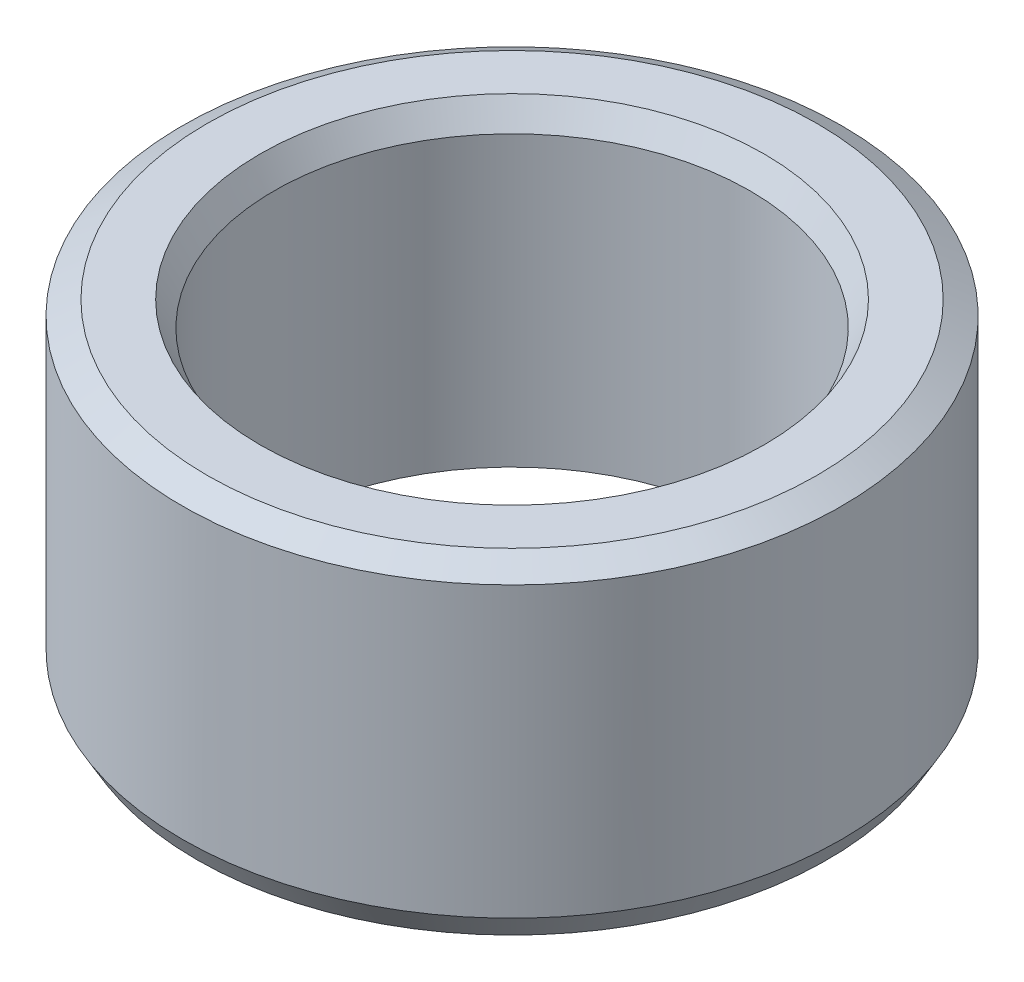
ISO-10303-21;
HEADER;
FILE_DESCRIPTION(('STEP AP214'),'2;1');
FILE_NAME('part.step','',(''),(''),'','','');
FILE_SCHEMA(('AUTOMOTIVE_DESIGN { 1 0 10303 214 1 1 1 1 }'));
ENDSEC;
DATA;
#1=APPLICATION_CONTEXT('core data for automotive mechanical design processes');
#2=APPLICATION_PROTOCOL_DEFINITION('international standard','automotive_design',2000,#1);
#3=PRODUCT_CONTEXT('',#1,'mechanical');
#4=PRODUCT('Part','Part','',(#3));
#5=PRODUCT_RELATED_PRODUCT_CATEGORY('part','',(#4));
#6=PRODUCT_DEFINITION_FORMATION('','',#4);
#7=PRODUCT_DEFINITION_CONTEXT('part definition',#1,'design');
#8=PRODUCT_DEFINITION('design','',#6,#7);
#9=PRODUCT_DEFINITION_SHAPE('','',#8);
#10=(LENGTH_UNIT() NAMED_UNIT(*) SI_UNIT(.MILLI.,.METRE.));
#11=(NAMED_UNIT(*) PLANE_ANGLE_UNIT() SI_UNIT($,.RADIAN.));
#12=(NAMED_UNIT(*) SI_UNIT($,.STERADIAN.) SOLID_ANGLE_UNIT());
#13=UNCERTAINTY_MEASURE_WITH_UNIT(LENGTH_MEASURE(1.E-05),#10,'distance_accuracy_value','');
#14=(GEOMETRIC_REPRESENTATION_CONTEXT(3) GLOBAL_UNCERTAINTY_ASSIGNED_CONTEXT((#13)) GLOBAL_UNIT_ASSIGNED_CONTEXT((#10,
#11,#12)) REPRESENTATION_CONTEXT('',''));
#15=CARTESIAN_POINT('',(0.,0.,0.));
#16=DIRECTION('',(0.,0.,1.));
#17=DIRECTION('',(1.,0.,0.));
#18=AXIS2_PLACEMENT_3D('',#15,#16,#17);
#19=CARTESIAN_POINT('',(0.,22.3650630023718,0.));
#20=DIRECTION('',(0.,-1.,0.));
#21=DIRECTION('',(0.,0.,-1.));
#22=AXIS2_PLACEMENT_3D('',#19,#20,#21);
#23=CYLINDRICAL_SURFACE('',#22,22.5);
#24=CARTESIAN_POINT('',(0.,1.68651742115444,0.));
#25=DIRECTION('',(0.,1.,0.));
#26=DIRECTION('',(0.,0.,1.));
#27=AXIS2_PLACEMENT_3D('',#24,#25,#26);
#28=CIRCLE('',#27,22.5);
#29=CARTESIAN_POINT('',(0.,1.68651742115444,-22.5));
#30=VERTEX_POINT('',#29);
#31=EDGE_CURVE('E10',#30,#30,#28,.T.);
#32=CARTESIAN_POINT('',(0.,21.3913517152753,0.));
#33=DIRECTION('',(0.,1.,0.));
#34=DIRECTION('',(0.,0.,1.));
#35=AXIS2_PLACEMENT_3D('',#32,#33,#34);
#36=CIRCLE('',#35,22.5);
#37=CARTESIAN_POINT('',(0.,21.3913517152753,-22.5));
#38=VERTEX_POINT('',#37);
#39=EDGE_CURVE('E50',#38,#38,#36,.F.);
#40=CARTESIAN_POINT('',(0.,1.68651742115444,-22.5));
#41=CARTESIAN_POINT('',(0.,1.8917761117182,-22.5));
#42=CARTESIAN_POINT('',(0.,2.09703480228196,-22.5));
#43=CARTESIAN_POINT('',(0.,2.50755218340948,-22.5));
#44=CARTESIAN_POINT('',(0.,2.71281087397324,-22.5));
#45=CARTESIAN_POINT('',(0.,3.12332825510076,-22.5));
#46=CARTESIAN_POINT('',(0.,3.32858694566452,-22.5));
#47=CARTESIAN_POINT('',(0.,3.73910432679203,-22.5));
#48=CARTESIAN_POINT('',(0.,3.94436301735579,-22.5));
#49=CARTESIAN_POINT('',(0.,4.35488039848331,-22.5));
#50=CARTESIAN_POINT('',(0.,4.56013908904707,-22.5));
#51=CARTESIAN_POINT('',(0.,4.97065647017459,-22.5));
#52=CARTESIAN_POINT('',(0.,5.17591516073835,-22.5));
#53=CARTESIAN_POINT('',(0.,5.58643254186587,-22.5));
#54=CARTESIAN_POINT('',(0.,5.79169123242963,-22.5));
#55=CARTESIAN_POINT('',(0.,6.20220861355714,-22.5));
#56=CARTESIAN_POINT('',(0.,6.4074673041209,-22.5));
#57=CARTESIAN_POINT('',(0.,6.81798468524842,-22.5));
#58=CARTESIAN_POINT('',(0.,7.02324337581218,-22.5));
#59=CARTESIAN_POINT('',(0.,7.4337607569397,-22.5));
#60=CARTESIAN_POINT('',(0.,7.63901944750346,-22.5));
#61=CARTESIAN_POINT('',(0.,8.04953682863097,-22.5));
#62=CARTESIAN_POINT('',(0.,8.25479551919473,-22.5));
#63=CARTESIAN_POINT('',(0.,8.66531290032225,-22.5));
#64=CARTESIAN_POINT('',(0.,8.87057159088601,-22.5));
#65=CARTESIAN_POINT('',(0.,9.28108897201353,-22.5));
#66=CARTESIAN_POINT('',(0.,9.48634766257729,-22.5));
#67=CARTESIAN_POINT('',(0.,9.89686504370481,-22.5));
#68=CARTESIAN_POINT('',(0.,10.1021237342686,-22.5));
#69=CARTESIAN_POINT('',(0.,10.5126411153961,-22.5));
#70=CARTESIAN_POINT('',(0.,10.7178998059598,-22.5));
#71=CARTESIAN_POINT('',(0.,11.1284171870874,-22.5));
#72=CARTESIAN_POINT('',(0.,11.3336758776511,-22.5));
#73=CARTESIAN_POINT('',(0.,11.7441932587786,-22.5));
#74=CARTESIAN_POINT('',(0.,11.9494519493424,-22.5));
#75=CARTESIAN_POINT('',(0.,12.3599693304699,-22.5));
#76=CARTESIAN_POINT('',(0.,12.5652280210337,-22.5));
#77=CARTESIAN_POINT('',(0.,12.9757454021612,-22.5));
#78=CARTESIAN_POINT('',(0.,13.181004092725,-22.5));
#79=CARTESIAN_POINT('',(0.,13.5915214738525,-22.5));
#80=CARTESIAN_POINT('',(0.,13.7967801644162,-22.5));
#81=CARTESIAN_POINT('',(0.,14.2072975455437,-22.5));
#82=CARTESIAN_POINT('',(0.,14.4125562361075,-22.5));
#83=CARTESIAN_POINT('',(0.,14.823073617235,-22.5));
#84=CARTESIAN_POINT('',(0.,15.0283323077988,-22.5));
#85=CARTESIAN_POINT('',(0.,15.4388496889263,-22.5));
#86=CARTESIAN_POINT('',(0.,15.6441083794901,-22.5));
#87=CARTESIAN_POINT('',(0.,16.0546257606176,-22.5));
#88=CARTESIAN_POINT('',(0.,16.2598844511813,-22.5));
#89=CARTESIAN_POINT('',(0.,16.6704018323089,-22.5));
#90=CARTESIAN_POINT('',(0.,16.8756605228726,-22.5));
#91=CARTESIAN_POINT('',(0.,17.2861779040001,-22.5));
#92=CARTESIAN_POINT('',(0.,17.4914365945639,-22.5));
#93=CARTESIAN_POINT('',(0.,17.9019539756914,-22.5));
#94=CARTESIAN_POINT('',(0.,18.1072126662552,-22.5));
#95=CARTESIAN_POINT('',(0.,18.5177300473827,-22.5));
#96=CARTESIAN_POINT('',(0.,18.7229887379465,-22.5));
#97=CARTESIAN_POINT('',(0.,19.133506119074,-22.5));
#98=CARTESIAN_POINT('',(0.,19.3387648096377,-22.5));
#99=CARTESIAN_POINT('',(0.,19.7492821907652,-22.5));
#100=CARTESIAN_POINT('',(0.,19.954540881329,-22.5));
#101=CARTESIAN_POINT('',(0.,20.3650582624565,-22.5));
#102=CARTESIAN_POINT('',(0.,20.5703169530203,-22.5));
#103=CARTESIAN_POINT('',(0.,20.9808343341478,-22.5));
#104=CARTESIAN_POINT('',(0.,21.1860930247116,-22.5));
#105=CARTESIAN_POINT('',(0.,21.3913517152753,-22.5));
#106=B_SPLINE_CURVE_WITH_KNOTS('',3,(#40,#41,#42,#43,#44,#45,#46,#47,#48,#49,#50,#51,#52,#53,
#54,#55,#56,#57,#58,#59,#60,#61,#62,#63,#64,#65,#66,#67,#68,#69,#70,#71,#72,#73,#74,#75,#76,#77,
#78,#79,#80,#81,#82,#83,#84,#85,#86,#87,#88,#89,#90,#91,#92,#93,#94,#95,#96,#97,#98,#99,#100,
#101,#102,#103,#104,#105),.UNSPECIFIED.,.F.,.F.,(4,2,2,2,2,2,2,2,2,2,2,2,2,2,2,2,2,2,2,2,2,2,2,
2,2,2,2,2,2,2,2,2,4),(0.,0.615776071691276,1.23155214338256,1.84732821507383,2.46310428676511,
3.07888035845639,3.69465643014767,4.31043250183894,4.92620857353022,5.5419846452215,
6.15776071691277,6.77353678860405,7.38931286029533,8.0050889319866,8.62086500367788,
9.23664107536916,9.85241714706044,10.4681932187517,11.083969290443,11.6997453621343,
12.3155214338255,12.9312975055168,13.5470735772081,14.1628496488994,14.7786257205907,
15.3944017922819,16.0101778639732,16.6259539356645,17.2417300073558,17.857506079047,
18.4732821507383,19.0890582224296,19.7048342941209),.UNSPECIFIED.);
#107=EDGE_CURVE('BSEAM39',#30,#38,#106,.T.);
#108=ORIENTED_EDGE('',*,*,#31,.T.);
#109=ORIENTED_EDGE('',*,*,#39,.T.);
#110=ORIENTED_EDGE('',*,*,#107,.T.);
#111=ORIENTED_EDGE('',*,*,#107,.F.);
#112=EDGE_LOOP('',(#108,#110,#109,#111));
#113=FACE_BOUND('',#112,.T.);
#114=ADVANCED_FACE('F39',(#113),#23,.T.);
#115=CARTESIAN_POINT('',(0.,22.3650630023718,0.));
#116=DIRECTION('',(0.,1.,0.));
#117=DIRECTION('',(0.,0.,1.));
#118=AXIS2_PLACEMENT_3D('',#115,#116,#117);
#119=PLANE('',#118);
#120=CARTESIAN_POINT('',(0.,22.3650630023718,0.));
#121=DIRECTION('',(0.,1.,0.));
#122=DIRECTION('',(0.,0.,1.));
#123=AXIS2_PLACEMENT_3D('',#120,#121,#122);
#124=CIRCLE('',#123,17.2061405656379);
#125=CARTESIAN_POINT('',(0.,22.3650630023718,17.2061405656379));
#126=VERTEX_POINT('',#125);
#127=EDGE_CURVE('E58',#126,#126,#124,.F.);
#128=ORIENTED_EDGE('',*,*,#127,.T.);
#129=EDGE_LOOP('',(#128));
#130=FACE_BOUND('',#129,.T.);
#131=CARTESIAN_POINT('',(0.,22.3650630023718,0.));
#132=DIRECTION('',(0.,1.,0.));
#133=DIRECTION('',(0.,0.,1.));
#134=AXIS2_PLACEMENT_3D('',#131,#132,#133);
#135=CIRCLE('',#134,20.8134825788457);
#136=CARTESIAN_POINT('',(0.,22.3650630023718,20.8134825788457));
#137=VERTEX_POINT('',#136);
#138=EDGE_CURVE('E61',#137,#137,#135,.T.);
#139=ORIENTED_EDGE('',*,*,#138,.T.);
#140=EDGE_LOOP('',(#139));
#141=FACE_BOUND('',#140,.T.);
#142=ADVANCED_FACE('F88',(#130,#141),#119,.T.);
#143=CARTESIAN_POINT('',(0.,0.,0.));
#144=DIRECTION('',(0.,1.,0.));
#145=DIRECTION('',(0.,0.,1.));
#146=AXIS2_PLACEMENT_3D('',#143,#144,#145);
#147=PLANE('',#146);
#148=CARTESIAN_POINT('',(0.,0.,0.));
#149=DIRECTION('',(0.,1.,0.));
#150=DIRECTION('',(0.,0.,1.));
#151=AXIS2_PLACEMENT_3D('',#148,#149,#150);
#152=CIRCLE('',#151,17.9189466996957);
#153=CARTESIAN_POINT('',(0.,0.,17.9189466996957));
#154=VERTEX_POINT('',#153);
#155=EDGE_CURVE('E51',#154,#154,#152,.T.);
#156=ORIENTED_EDGE('',*,*,#155,.T.);
#157=EDGE_LOOP('',(#156));
#158=FACE_BOUND('',#157,.T.);
#159=CARTESIAN_POINT('',(0.,0.,0.));
#160=DIRECTION('',(0.,1.,0.));
#161=DIRECTION('',(0.,0.,1.));
#162=AXIS2_PLACEMENT_3D('',#159,#160,#161);
#163=CIRCLE('',#162,21.5262887129035);
#164=CARTESIAN_POINT('',(0.,0.,21.5262887129035));
#165=VERTEX_POINT('',#164);
#166=EDGE_CURVE('E54',#165,#165,#163,.F.);
#167=ORIENTED_EDGE('',*,*,#166,.T.);
#168=EDGE_LOOP('',(#167));
#169=FACE_BOUND('',#168,.T.);
#170=ADVANCED_FACE('F83',(#158,#169),#147,.F.);
#171=CARTESIAN_POINT('',(0.,22.3650630023718,0.));
#172=DIRECTION('',(0.,-1.,0.));
#173=DIRECTION('',(0.,0.,-1.));
#174=AXIS2_PLACEMENT_3D('',#171,#172,#173);
#175=CYLINDRICAL_SURFACE('',#174,16.2324292785414);
#176=CARTESIAN_POINT('',(0.,20.6785455812173,0.));
#177=DIRECTION('',(0.,1.,0.));
#178=DIRECTION('',(0.,0.,1.));
#179=AXIS2_PLACEMENT_3D('',#176,#177,#178);
#180=CIRCLE('',#179,16.2324292785414);
#181=CARTESIAN_POINT('',(0.,20.6785455812173,-16.2324292785414));
#182=VERTEX_POINT('',#181);
#183=EDGE_CURVE('E67',#182,#182,#180,.T.);
#184=CARTESIAN_POINT('',(0.,0.97371128709647,0.));
#185=DIRECTION('',(0.,1.,0.));
#186=DIRECTION('',(0.,0.,1.));
#187=AXIS2_PLACEMENT_3D('',#184,#185,#186);
#188=CIRCLE('',#187,16.2324292785414);
#189=CARTESIAN_POINT('',(0.,0.973711287096467,-16.2324292785414));
#190=VERTEX_POINT('',#189);
#191=EDGE_CURVE('E69',#190,#190,#188,.F.);
#192=CARTESIAN_POINT('',(0.,20.6785455812173,-16.2324292785414));
#193=CARTESIAN_POINT('',(0.,20.4732868906536,-16.2324292785414));
#194=CARTESIAN_POINT('',(0.,20.2680282000898,-16.2324292785414));
#195=CARTESIAN_POINT('',(0.,19.8575108189623,-16.2324292785414));
#196=CARTESIAN_POINT('',(0.,19.6522521283985,-16.2324292785414));
#197=CARTESIAN_POINT('',(0.,19.241734747271,-16.2324292785414));
#198=CARTESIAN_POINT('',(0.,19.0364760567073,-16.2324292785414));
#199=CARTESIAN_POINT('',(0.,18.6259586755797,-16.2324292785414));
#200=CARTESIAN_POINT('',(0.,18.420699985016,-16.2324292785414));
#201=CARTESIAN_POINT('',(0.,18.0101826038885,-16.2324292785414));
#202=CARTESIAN_POINT('',(0.,17.8049239133247,-16.2324292785414));
#203=CARTESIAN_POINT('',(0.,17.3944065321972,-16.2324292785414));
#204=CARTESIAN_POINT('',(0.,17.1891478416334,-16.2324292785414));
#205=CARTESIAN_POINT('',(0.,16.7786304605059,-16.2324292785414));
#206=CARTESIAN_POINT('',(0.,16.5733717699421,-16.2324292785414));
#207=CARTESIAN_POINT('',(0.,16.1628543888146,-16.2324292785414));
#208=CARTESIAN_POINT('',(0.,15.9575956982509,-16.2324292785414));
#209=CARTESIAN_POINT('',(0.,15.5470783171234,-16.2324292785414));
#210=CARTESIAN_POINT('',(0.,15.3418196265596,-16.2324292785414));
#211=CARTESIAN_POINT('',(0.,14.9313022454321,-16.2324292785414));
#212=CARTESIAN_POINT('',(0.,14.7260435548683,-16.2324292785414));
#213=CARTESIAN_POINT('',(0.,14.3155261737408,-16.2324292785414));
#214=CARTESIAN_POINT('',(0.,14.110267483177,-16.2324292785414));
#215=CARTESIAN_POINT('',(0.,13.6997501020495,-16.2324292785414));
#216=CARTESIAN_POINT('',(0.,13.4944914114858,-16.2324292785414));
#217=CARTESIAN_POINT('',(0.,13.0839740303582,-16.2324292785414));
#218=CARTESIAN_POINT('',(0.,12.8787153397945,-16.2324292785414));
#219=CARTESIAN_POINT('',(0.,12.468197958667,-16.2324292785414));
#220=CARTESIAN_POINT('',(0.,12.2629392681032,-16.2324292785414));
#221=CARTESIAN_POINT('',(0.,11.8524218869757,-16.2324292785414));
#222=CARTESIAN_POINT('',(0.,11.6471631964119,-16.2324292785414));
#223=CARTESIAN_POINT('',(0.,11.2366458152844,-16.2324292785414));
#224=CARTESIAN_POINT('',(0.,11.0313871247207,-16.2324292785414));
#225=CARTESIAN_POINT('',(0.,10.6208697435931,-16.2324292785414));
#226=CARTESIAN_POINT('',(0.,10.4156110530294,-16.2324292785414));
#227=CARTESIAN_POINT('',(0.,10.0050936719019,-16.2324292785414));
#228=CARTESIAN_POINT('',(0.,9.7998349813381,-16.2324292785414));
#229=CARTESIAN_POINT('',(0.,9.38931760021058,-16.2324292785414));
#230=CARTESIAN_POINT('',(0.,9.18405890964682,-16.2324292785414));
#231=CARTESIAN_POINT('',(0.,8.77354152851931,-16.2324292785414));
#232=CARTESIAN_POINT('',(0.,8.56828283795554,-16.2324292785414));
#233=CARTESIAN_POINT('',(0.,8.15776545682803,-16.2324292785414));
#234=CARTESIAN_POINT('',(0.,7.95250676626427,-16.2324292785414));
#235=CARTESIAN_POINT('',(0.,7.54198938513675,-16.2324292785414));
#236=CARTESIAN_POINT('',(0.,7.33673069457299,-16.2324292785414));
#237=CARTESIAN_POINT('',(0.,6.92621331344547,-16.2324292785414));
#238=CARTESIAN_POINT('',(0.,6.72095462288172,-16.2324292785414));
#239=CARTESIAN_POINT('',(0.,6.3104372417542,-16.2324292785414));
#240=CARTESIAN_POINT('',(0.,6.10517855119044,-16.2324292785414));
#241=CARTESIAN_POINT('',(0.,5.69466117006292,-16.2324292785414));
#242=CARTESIAN_POINT('',(0.,5.48940247949916,-16.2324292785414));
#243=CARTESIAN_POINT('',(0.,5.07888509837164,-16.2324292785414));
#244=CARTESIAN_POINT('',(0.,4.87362640780788,-16.2324292785414));
#245=CARTESIAN_POINT('',(0.,4.46310902668037,-16.2324292785414));
#246=CARTESIAN_POINT('',(0.,4.25785033611661,-16.2324292785414));
#247=CARTESIAN_POINT('',(0.,3.84733295498909,-16.2324292785414));
#248=CARTESIAN_POINT('',(0.,3.64207426442533,-16.2324292785414));
#249=CARTESIAN_POINT('',(0.,3.23155688329781,-16.2324292785414));
#250=CARTESIAN_POINT('',(0.,3.02629819273405,-16.2324292785414));
#251=CARTESIAN_POINT('',(0.,2.61578081160654,-16.2324292785414));
#252=CARTESIAN_POINT('',(0.,2.41052212104278,-16.2324292785414));
#253=CARTESIAN_POINT('',(0.,2.00000473991526,-16.2324292785414));
#254=CARTESIAN_POINT('',(0.,1.7947460493515,-16.2324292785414));
#255=CARTESIAN_POINT('',(0.,1.38422866822398,-16.2324292785414));
#256=CARTESIAN_POINT('',(0.,1.17896997766023,-16.2324292785414));
#257=CARTESIAN_POINT('',(0.,0.973711287096467,-16.2324292785414));
#258=B_SPLINE_CURVE_WITH_KNOTS('',3,(#192,#193,#194,#195,#196,#197,#198,#199,#200,#201,#202,
#203,#204,#205,#206,#207,#208,#209,#210,#211,#212,#213,#214,#215,#216,#217,#218,#219,#220,#221,
#222,#223,#224,#225,#226,#227,#228,#229,#230,#231,#232,#233,#234,#235,#236,#237,#238,#239,#240,
#241,#242,#243,#244,#245,#246,#247,#248,#249,#250,#251,#252,#253,#254,#255,#256,#257),
.UNSPECIFIED.,.F.,.F.,(4,2,2,2,2,2,2,2,2,2,2,2,2,2,2,2,2,2,2,2,2,2,2,2,2,2,2,2,2,2,2,2,4),(0.,
0.61577607169128,1.23155214338256,1.84732821507383,2.46310428676511,3.07888035845639,
3.69465643014766,4.31043250183894,4.92620857353022,5.54198464522149,6.15776071691277,
6.77353678860405,7.38931286029533,8.0050889319866,8.62086500367788,9.23664107536916,
9.85241714706043,10.4681932187517,11.083969290443,11.6997453621343,12.3155214338255,
12.9312975055168,13.5470735772081,14.1628496488994,14.7786257205906,15.3944017922819,
16.0101778639732,16.6259539356645,17.2417300073558,17.857506079047,18.4732821507383,
19.0890582224296,19.7048342941209),.UNSPECIFIED.);
#259=EDGE_CURVE('BSEAM71',#182,#190,#258,.T.);
#260=ORIENTED_EDGE('',*,*,#183,.T.);
#261=ORIENTED_EDGE('',*,*,#191,.T.);
#262=ORIENTED_EDGE('',*,*,#259,.T.);
#263=ORIENTED_EDGE('',*,*,#259,.F.);
#264=EDGE_LOOP('',(#260,#262,#261,#263));
#265=FACE_BOUND('',#264,.T.);
#266=ADVANCED_FACE('F71',(#265),#175,.F.);
#267=CARTESIAN_POINT('',(0.,20.6785455812173,0.));
#268=DIRECTION('',(0.,1.,0.));
#269=DIRECTION('',(0.,0.,1.));
#270=AXIS2_PLACEMENT_3D('',#267,#268,#269);
#271=CONICAL_SURFACE('',#270,16.2324292785414,0.523598775598303);
#272=ORIENTED_EDGE('',*,*,#127,.F.);
#273=EDGE_LOOP('',(#272));
#274=FACE_BOUND('',#273,.T.);
#275=ORIENTED_EDGE('',*,*,#183,.F.);
#276=EDGE_LOOP('',(#275));
#277=FACE_BOUND('',#276,.T.);
#278=ADVANCED_FACE('F77',(#274,#277),#271,.F.);
#279=CARTESIAN_POINT('',(0.,0.,0.));
#280=DIRECTION('',(0.,-1.,0.));
#281=DIRECTION('',(0.,0.,-1.));
#282=AXIS2_PLACEMENT_3D('',#279,#280,#281);
#283=CONICAL_SURFACE('',#282,17.9189466996957,1.04719755119659);
#284=ORIENTED_EDGE('',*,*,#191,.F.);
#285=EDGE_LOOP('',(#284));
#286=FACE_BOUND('',#285,.T.);
#287=ORIENTED_EDGE('',*,*,#155,.F.);
#288=EDGE_LOOP('',(#287));
#289=FACE_BOUND('',#288,.T.);
#290=ADVANCED_FACE('F73',(#286,#289),#283,.F.);
#291=CARTESIAN_POINT('',(0.,1.68651742115444,0.));
#292=DIRECTION('',(0.,1.,0.));
#293=DIRECTION('',(0.,0.,1.));
#294=AXIS2_PLACEMENT_3D('',#291,#292,#293);
#295=CONICAL_SURFACE('',#294,22.5,0.523598775598304);
#296=ORIENTED_EDGE('',*,*,#166,.F.);
#297=EDGE_LOOP('',(#296));
#298=FACE_BOUND('',#297,.T.);
#299=ORIENTED_EDGE('',*,*,#31,.F.);
#300=EDGE_LOOP('',(#299));
#301=FACE_BOUND('',#300,.T.);
#302=ADVANCED_FACE('F76',(#298,#301),#295,.T.);
#303=CARTESIAN_POINT('',(0.,22.3650630023718,0.));
#304=DIRECTION('',(0.,-1.,0.));
#305=DIRECTION('',(0.,0.,-1.));
#306=AXIS2_PLACEMENT_3D('',#303,#304,#305);
#307=CONICAL_SURFACE('',#306,20.8134825788457,1.04719755119659);
#308=ORIENTED_EDGE('',*,*,#39,.F.);
#309=EDGE_LOOP('',(#308));
#310=FACE_BOUND('',#309,.T.);
#311=ORIENTED_EDGE('',*,*,#138,.F.);
#312=EDGE_LOOP('',(#311));
#313=FACE_BOUND('',#312,.T.);
#314=ADVANCED_FACE('F45',(#310,#313),#307,.T.);
#315=CLOSED_SHELL('',(#114,#142,#170,#266,#278,#290,#302,#314));
#316=MANIFOLD_SOLID_BREP('B2',#315);
#317=ADVANCED_BREP_SHAPE_REPRESENTATION('',(#18,#316),#14);
#318=SHAPE_DEFINITION_REPRESENTATION(#9,#317);
ENDSEC;
END-ISO-10303-21;
